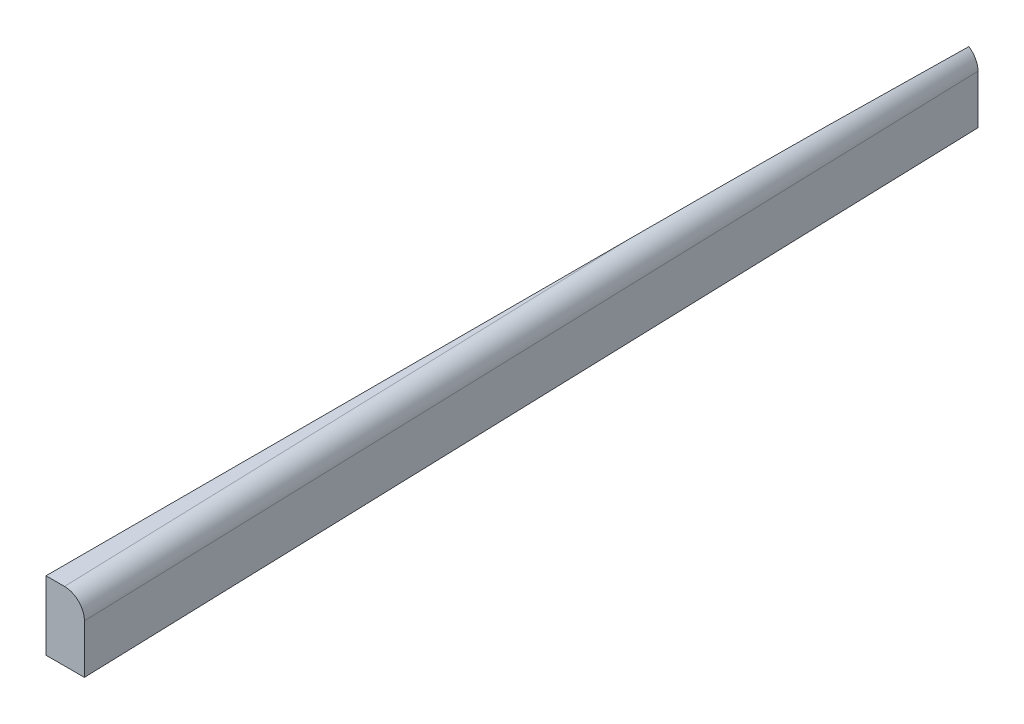
ISO-10303-21;
HEADER;
FILE_DESCRIPTION(('STEP AP214'),'2;1');
FILE_NAME('part.step','',(''),(''),'','','');
FILE_SCHEMA(('AUTOMOTIVE_DESIGN { 1 0 10303 214 1 1 1 1 }'));
ENDSEC;
DATA;
#1=APPLICATION_CONTEXT('core data for automotive mechanical design processes');
#2=APPLICATION_PROTOCOL_DEFINITION('international standard','automotive_design',2000,#1);
#3=PRODUCT_CONTEXT('',#1,'mechanical');
#4=PRODUCT('Part','Part','',(#3));
#5=PRODUCT_RELATED_PRODUCT_CATEGORY('part','',(#4));
#6=PRODUCT_DEFINITION_FORMATION('','',#4);
#7=PRODUCT_DEFINITION_CONTEXT('part definition',#1,'design');
#8=PRODUCT_DEFINITION('design','',#6,#7);
#9=PRODUCT_DEFINITION_SHAPE('','',#8);
#10=(LENGTH_UNIT() NAMED_UNIT(*) SI_UNIT(.MILLI.,.METRE.));
#11=(NAMED_UNIT(*) PLANE_ANGLE_UNIT() SI_UNIT($,.RADIAN.));
#12=(NAMED_UNIT(*) SI_UNIT($,.STERADIAN.) SOLID_ANGLE_UNIT());
#13=UNCERTAINTY_MEASURE_WITH_UNIT(LENGTH_MEASURE(1.E-05),#10,'distance_accuracy_value','');
#14=(GEOMETRIC_REPRESENTATION_CONTEXT(3) GLOBAL_UNCERTAINTY_ASSIGNED_CONTEXT((#13)) GLOBAL_UNIT_ASSIGNED_CONTEXT((#10,
#11,#12)) REPRESENTATION_CONTEXT('',''));
#15=CARTESIAN_POINT('',(0.,0.,0.));
#16=DIRECTION('',(0.,0.,1.));
#17=DIRECTION('',(1.,0.,0.));
#18=AXIS2_PLACEMENT_3D('',#15,#16,#17);
#19=CARTESIAN_POINT('',(0.,0.,-584.2));
#20=DIRECTION('',(0.,0.,1.));
#21=DIRECTION('',(1.,0.,0.));
#22=AXIS2_PLACEMENT_3D('',#19,#20,#21);
#23=PLANE('',#22);
#24=CARTESIAN_POINT('',(29.9639479786131,37.211,-584.2));
#25=DIRECTION('',(0.,0.,1.));
#26=DIRECTION('',(1.,0.,0.));
#27=AXIS2_PLACEMENT_3D('',#24,#25,#26);
#28=ELLIPSE('',#27,12.7063746568218,12.7);
#29=CARTESIAN_POINT('',(29.9639479786131,49.911,-584.2));
#30=VERTEX_POINT('',#29);
#31=CARTESIAN_POINT('',(42.6703226354349,37.211,-584.2));
#32=VERTEX_POINT('',#31);
#33=EDGE_CURVE('E109',#30,#32,#28,.F.);
#34=ORIENTED_EDGE('',*,*,#33,.F.);
#35=DIRECTION('',(-1.,0.,0.));
#36=VECTOR('',#35,1.);
#37=CARTESIAN_POINT('',(-49.911,49.911,-584.2));
#38=LINE('',#37,#36);
#39=CARTESIAN_POINT('',(18.161,49.911,-584.2));
#40=VERTEX_POINT('',#39);
#41=EDGE_CURVE('E110',#30,#40,#38,.T.);
#42=ORIENTED_EDGE('',*,*,#41,.T.);
#43=DIRECTION('',(0.,-1.,0.));
#44=VECTOR('',#43,1.);
#45=CARTESIAN_POINT('',(18.161,0.,-584.2));
#46=LINE('',#45,#44);
#47=CARTESIAN_POINT('',(18.161,5.96900000000002,-584.2));
#48=VERTEX_POINT('',#47);
#49=EDGE_CURVE('E108',#40,#48,#46,.T.);
#50=ORIENTED_EDGE('',*,*,#49,.T.);
#51=DIRECTION('',(1.,0.,0.));
#52=VECTOR('',#51,1.);
#53=CARTESIAN_POINT('',(0.,5.96900000000002,-584.2));
#54=LINE('',#53,#52);
#55=CARTESIAN_POINT('',(42.6703226354349,5.96900000000002,-584.2));
#56=VERTEX_POINT('',#55);
#57=EDGE_CURVE('E95',#48,#56,#54,.T.);
#58=ORIENTED_EDGE('',*,*,#57,.T.);
#59=DIRECTION('',(0.,1.,0.));
#60=VECTOR('',#59,1.);
#61=CARTESIAN_POINT('',(42.6703226354349,0.,-584.2));
#62=LINE('',#61,#60);
#63=EDGE_CURVE('E105',#56,#32,#62,.T.);
#64=ORIENTED_EDGE('',*,*,#63,.T.);
#65=EDGE_LOOP('',(#34,#42,#50,#58,#64));
#66=FACE_BOUND('',#65,.T.);
#67=ADVANCED_FACE('F43',(#66),#23,.T.);
#68=CARTESIAN_POINT('',(0.,5.96900000000002,0.));
#69=DIRECTION('',(0.,1.,0.));
#70=DIRECTION('',(0.,0.,1.));
#71=AXIS2_PLACEMENT_3D('',#68,#69,#70);
#72=PLANE('',#71);
#73=ORIENTED_EDGE('',*,*,#57,.F.);
#74=DIRECTION('',(0.,0.,1.));
#75=VECTOR('',#74,1.);
#76=CARTESIAN_POINT('',(18.161,5.96900000000002,0.));
#77=LINE('',#76,#75);
#78=CARTESIAN_POINT('',(18.161,5.96900000000002,-1173.17130026192));
#79=VERTEX_POINT('',#78);
#80=EDGE_CURVE('E120',#79,#48,#77,.T.);
#81=ORIENTED_EDGE('',*,*,#80,.F.);
#82=DIRECTION('',(-1.,0.,0.));
#83=VECTOR('',#82,1.);
#84=CARTESIAN_POINT('',(0.,5.96900000000002,-1173.17130026192));
#85=LINE('',#84,#83);
#86=CARTESIAN_POINT('',(24.0069483527925,5.96900000000002,-1173.17130026192));
#87=VERTEX_POINT('',#86);
#88=EDGE_CURVE('E97',#87,#79,#85,.T.);
#89=ORIENTED_EDGE('',*,*,#88,.F.);
#90=DIRECTION('',(-0.0316721902279269,0.,-0.999498310336824));
#91=VECTOR('',#90,1.);
#92=CARTESIAN_POINT('',(61.1211296763861,5.96900000000002,-1.93681172447798));
#93=LINE('',#92,#91);
#94=EDGE_CURVE('E91',#56,#87,#93,.T.);
#95=ORIENTED_EDGE('',*,*,#94,.F.);
#96=EDGE_LOOP('',(#73,#81,#89,#95));
#97=FACE_BOUND('',#96,.T.);
#98=ADVANCED_FACE('F93',(#97),#72,.F.);
#99=CARTESIAN_POINT('',(48.4275011351085,37.211,-1.5345749085833));
#100=DIRECTION('',(0.0316721902279269,0.,0.999498310336824));
#101=DIRECTION('',(0.999498310336824,0.,-0.0316721902279269));
#102=AXIS2_PLACEMENT_3D('',#99,#100,#101);
#103=CYLINDRICAL_SURFACE('',#102,12.7);
#104=DIRECTION('',(0.0316721902279269,0.,0.999498310336824));
#105=VECTOR('',#104,1.);
#106=CARTESIAN_POINT('',(49.1815040674601,49.911,22.2599480293983));
#107=LINE('',#106,#105);
#108=CARTESIAN_POINT('',(18.161,49.911,-956.672711129881));
#109=VERTEX_POINT('',#108);
#110=EDGE_CURVE('E66',#30,#109,#107,.F.);
#111=ORIENTED_EDGE('',*,*,#110,.F.);
#112=ORIENTED_EDGE('',*,*,#33,.T.);
#113=DIRECTION('',(0.0316721902279269,0.,0.999498310336824));
#114=VECTOR('',#113,1.);
#115=CARTESIAN_POINT('',(61.1211296763861,37.211,-1.93681172447798));
#116=LINE('',#115,#114);
#117=CARTESIAN_POINT('',(24.0069483527925,37.211,-1173.17130026192));
#118=VERTEX_POINT('',#117);
#119=EDGE_CURVE('E114',#118,#32,#116,.T.);
#120=ORIENTED_EDGE('',*,*,#119,.F.);
#121=CARTESIAN_POINT('',(11.3005736959708,37.211,-1173.17130026192));
#122=DIRECTION('',(0.,0.,1.));
#123=DIRECTION('',(1.,0.,0.));
#124=AXIS2_PLACEMENT_3D('',#121,#122,#123);
#125=ELLIPSE('',#124,12.7063746568218,12.7);
#126=CARTESIAN_POINT('',(18.161,47.900797172049,-1173.17130026192));
#127=VERTEX_POINT('',#126);
#128=EDGE_CURVE('E123',#127,#118,#125,.F.);
#129=ORIENTED_EDGE('',*,*,#128,.F.);
#130=CARTESIAN_POINT('',(18.161,37.211,-956.672711129881));
#131=DIRECTION('',(1.,0.,0.));
#132=DIRECTION('',(0.,0.,1.));
#133=AXIS2_PLACEMENT_3D('',#130,#131,#132);
#134=ELLIPSE('',#133,400.982688870118,12.7);
#135=EDGE_CURVE('E11',#109,#127,#134,.F.);
#136=ORIENTED_EDGE('',*,*,#135,.F.);
#137=EDGE_LOOP('',(#111,#112,#120,#129,#136));
#138=FACE_BOUND('',#137,.T.);
#139=ADVANCED_FACE('F137',(#138),#103,.T.);
#140=CARTESIAN_POINT('',(-49.911,49.911,25.4));
#141=DIRECTION('',(0.,-1.,0.));
#142=DIRECTION('',(0.,0.,-1.));
#143=AXIS2_PLACEMENT_3D('',#140,#141,#142);
#144=PLANE('',#143);
#145=ORIENTED_EDGE('',*,*,#41,.F.);
#146=ORIENTED_EDGE('',*,*,#110,.T.);
#147=DIRECTION('',(0.,0.,1.));
#148=VECTOR('',#147,1.);
#149=CARTESIAN_POINT('',(18.161,49.911,25.4));
#150=LINE('',#149,#148);
#151=EDGE_CURVE('E122',#109,#40,#150,.T.);
#152=ORIENTED_EDGE('',*,*,#151,.T.);
#153=EDGE_LOOP('',(#145,#146,#152));
#154=FACE_BOUND('',#153,.T.);
#155=ADVANCED_FACE('F154',(#154),#144,.F.);
#156=CARTESIAN_POINT('',(18.161,0.,0.));
#157=DIRECTION('',(1.,0.,0.));
#158=DIRECTION('',(0.,0.,-1.));
#159=AXIS2_PLACEMENT_3D('',#156,#157,#158);
#160=PLANE('',#159);
#161=ORIENTED_EDGE('',*,*,#49,.F.);
#162=ORIENTED_EDGE('',*,*,#151,.F.);
#163=ORIENTED_EDGE('',*,*,#135,.T.);
#164=DIRECTION('',(0.,1.,0.));
#165=VECTOR('',#164,1.);
#166=CARTESIAN_POINT('',(18.161,0.,-1173.17130026192));
#167=LINE('',#166,#165);
#168=EDGE_CURVE('E52',#79,#127,#167,.T.);
#169=ORIENTED_EDGE('',*,*,#168,.F.);
#170=ORIENTED_EDGE('',*,*,#80,.T.);
#171=EDGE_LOOP('',(#161,#162,#163,#169,#170));
#172=FACE_BOUND('',#171,.T.);
#173=ADVANCED_FACE('F45',(#172),#160,.F.);
#174=CARTESIAN_POINT('',(61.1211296763861,0.,-1.93681172447798));
#175=DIRECTION('',(-0.999498310336824,0.,0.0316721902279269));
#176=DIRECTION('',(0.0316721902279269,0.,0.999498310336824));
#177=AXIS2_PLACEMENT_3D('',#174,#175,#176);
#178=PLANE('',#177);
#179=ORIENTED_EDGE('',*,*,#63,.F.);
#180=ORIENTED_EDGE('',*,*,#94,.T.);
#181=DIRECTION('',(0.,1.,0.));
#182=VECTOR('',#181,1.);
#183=CARTESIAN_POINT('',(24.0069483527925,0.,-1173.17130026192));
#184=LINE('',#183,#182);
#185=EDGE_CURVE('E128',#87,#118,#184,.T.);
#186=ORIENTED_EDGE('',*,*,#185,.T.);
#187=ORIENTED_EDGE('',*,*,#119,.T.);
#188=EDGE_LOOP('',(#179,#180,#186,#187));
#189=FACE_BOUND('',#188,.T.);
#190=ADVANCED_FACE('F112',(#189),#178,.F.);
#191=CARTESIAN_POINT('',(0.,0.,-1173.17130026192));
#192=DIRECTION('',(0.,0.,1.));
#193=DIRECTION('',(1.,0.,0.));
#194=AXIS2_PLACEMENT_3D('',#191,#192,#193);
#195=PLANE('',#194);
#196=ORIENTED_EDGE('',*,*,#185,.F.);
#197=ORIENTED_EDGE('',*,*,#88,.T.);
#198=ORIENTED_EDGE('',*,*,#168,.T.);
#199=ORIENTED_EDGE('',*,*,#128,.T.);
#200=EDGE_LOOP('',(#196,#197,#198,#199));
#201=FACE_BOUND('',#200,.T.);
#202=ADVANCED_FACE('F138',(#201),#195,.F.);
#203=CLOSED_SHELL('',(#67,#98,#139,#155,#173,#190,#202));
#204=MANIFOLD_SOLID_BREP('B2',#203);
#205=ADVANCED_BREP_SHAPE_REPRESENTATION('',(#18,#204),#14);
#206=SHAPE_DEFINITION_REPRESENTATION(#9,#205);
ENDSEC;
END-ISO-10303-21;
